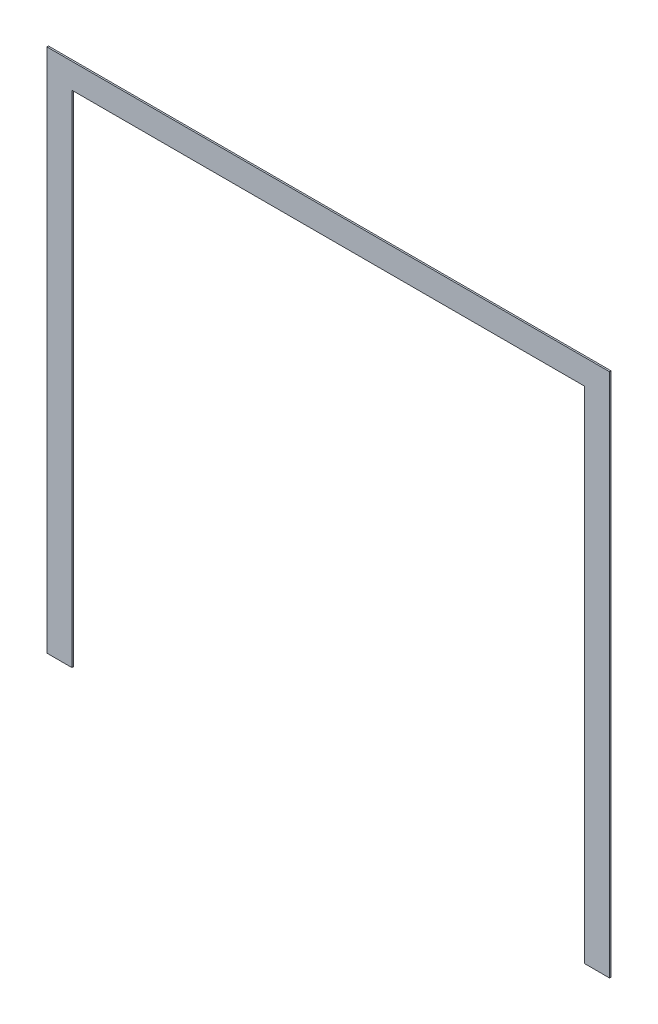
ISO-10303-21;
HEADER;
FILE_DESCRIPTION(('STEP AP214'),'2;1');
FILE_NAME('part.step','',(''),(''),'','','');
FILE_SCHEMA(('AUTOMOTIVE_DESIGN { 1 0 10303 214 1 1 1 1 }'));
ENDSEC;
DATA;
#1=APPLICATION_CONTEXT('core data for automotive mechanical design processes');
#2=APPLICATION_PROTOCOL_DEFINITION('international standard','automotive_design',2000,#1);
#3=PRODUCT_CONTEXT('',#1,'mechanical');
#4=PRODUCT('Part','Part','',(#3));
#5=PRODUCT_RELATED_PRODUCT_CATEGORY('part','',(#4));
#6=PRODUCT_DEFINITION_FORMATION('','',#4);
#7=PRODUCT_DEFINITION_CONTEXT('part definition',#1,'design');
#8=PRODUCT_DEFINITION('design','',#6,#7);
#9=PRODUCT_DEFINITION_SHAPE('','',#8);
#10=(LENGTH_UNIT() NAMED_UNIT(*) SI_UNIT(.MILLI.,.METRE.));
#11=(NAMED_UNIT(*) PLANE_ANGLE_UNIT() SI_UNIT($,.RADIAN.));
#12=(NAMED_UNIT(*) SI_UNIT($,.STERADIAN.) SOLID_ANGLE_UNIT());
#13=UNCERTAINTY_MEASURE_WITH_UNIT(LENGTH_MEASURE(1.E-05),#10,'distance_accuracy_value','');
#14=(GEOMETRIC_REPRESENTATION_CONTEXT(3) GLOBAL_UNCERTAINTY_ASSIGNED_CONTEXT((#13)) GLOBAL_UNIT_ASSIGNED_CONTEXT((#10,
#11,#12)) REPRESENTATION_CONTEXT('',''));
#15=CARTESIAN_POINT('',(0.,0.,0.));
#16=DIRECTION('',(0.,0.,1.));
#17=DIRECTION('',(1.,0.,0.));
#18=AXIS2_PLACEMENT_3D('',#15,#16,#17);
#19=CARTESIAN_POINT('',(386.733357334137,-2891.73158988953,0.));
#20=DIRECTION('',(0.,0.,1.));
#21=DIRECTION('',(1.,0.,0.));
#22=AXIS2_PLACEMENT_3D('',#19,#20,#21);
#23=PLANE('',#22);
#24=DIRECTION('',(1.,0.,0.));
#25=VECTOR('',#24,1.);
#26=CARTESIAN_POINT('',(386.733357334137,-2358.33158988953,0.));
#27=LINE('',#26,#25);
#28=CARTESIAN_POINT('',(958.233357334138,-2358.33158988953,0.));
#29=VERTEX_POINT('',#28);
#30=CARTESIAN_POINT('',(-184.766642665863,-2358.33158988953,0.));
#31=VERTEX_POINT('',#30);
#32=EDGE_CURVE('E124',#29,#31,#27,.F.);
#33=ORIENTED_EDGE('',*,*,#32,.F.);
#34=DIRECTION('',(0.,1.,0.));
#35=VECTOR('',#34,1.);
#36=CARTESIAN_POINT('',(958.233357334138,-2891.73158988953,0.));
#37=LINE('',#36,#35);
#38=CARTESIAN_POINT('',(958.233357334138,-3425.13158988953,0.));
#39=VERTEX_POINT('',#38);
#40=EDGE_CURVE('E119',#39,#29,#37,.T.);
#41=ORIENTED_EDGE('',*,*,#40,.F.);
#42=DIRECTION('',(1.,0.,0.));
#43=VECTOR('',#42,1.);
#44=CARTESIAN_POINT('',(932.833357334138,-3425.13158988953,0.));
#45=LINE('',#44,#43);
#46=CARTESIAN_POINT('',(907.433357334138,-3425.13158988953,0.));
#47=VERTEX_POINT('',#46);
#48=EDGE_CURVE('E113',#47,#39,#45,.T.);
#49=ORIENTED_EDGE('',*,*,#48,.F.);
#50=DIRECTION('',(0.,-1.,0.));
#51=VECTOR('',#50,1.);
#52=CARTESIAN_POINT('',(907.433357334138,-2917.13158988953,0.));
#53=LINE('',#52,#51);
#54=CARTESIAN_POINT('',(907.433357334138,-2409.13158988953,0.));
#55=VERTEX_POINT('',#54);
#56=EDGE_CURVE('E107',#55,#47,#53,.T.);
#57=ORIENTED_EDGE('',*,*,#56,.F.);
#58=DIRECTION('',(1.,0.,0.));
#59=VECTOR('',#58,1.);
#60=CARTESIAN_POINT('',(386.733357334137,-2409.13158988953,0.));
#61=LINE('',#60,#59);
#62=CARTESIAN_POINT('',(-133.966642665863,-2409.13158988953,0.));
#63=VERTEX_POINT('',#62);
#64=EDGE_CURVE('E101',#63,#55,#61,.T.);
#65=ORIENTED_EDGE('',*,*,#64,.F.);
#66=DIRECTION('',(0.,1.,0.));
#67=VECTOR('',#66,1.);
#68=CARTESIAN_POINT('',(-133.966642665863,-2917.13158988953,0.));
#69=LINE('',#68,#67);
#70=CARTESIAN_POINT('',(-133.966642665863,-3425.13158988953,0.));
#71=VERTEX_POINT('',#70);
#72=EDGE_CURVE('E77',#71,#63,#69,.T.);
#73=ORIENTED_EDGE('',*,*,#72,.F.);
#74=DIRECTION('',(1.,0.,0.));
#75=VECTOR('',#74,1.);
#76=CARTESIAN_POINT('',(-159.366642665863,-3425.13158988953,0.));
#77=LINE('',#76,#75);
#78=CARTESIAN_POINT('',(-184.766642665863,-3425.13158988953,0.));
#79=VERTEX_POINT('',#78);
#80=EDGE_CURVE('E79',#79,#71,#77,.T.);
#81=ORIENTED_EDGE('',*,*,#80,.F.);
#82=DIRECTION('',(0.,1.,0.));
#83=VECTOR('',#82,1.);
#84=CARTESIAN_POINT('',(-184.766642665863,-2891.73158988953,0.));
#85=LINE('',#84,#83);
#86=EDGE_CURVE('E17',#31,#79,#85,.F.);
#87=ORIENTED_EDGE('',*,*,#86,.F.);
#88=EDGE_LOOP('',(#33,#41,#49,#57,#65,#73,#81,#87));
#89=FACE_BOUND('',#88,.T.);
#90=ADVANCED_FACE('F14',(#89),#23,.F.);
#91=CARTESIAN_POINT('',(-184.766642665863,-2891.73158988953,3.175));
#92=DIRECTION('',(-1.,0.,0.));
#93=DIRECTION('',(0.,0.,1.));
#94=AXIS2_PLACEMENT_3D('',#91,#92,#93);
#95=PLANE('',#94);
#96=DIRECTION('',(0.,1.,0.));
#97=VECTOR('',#96,1.);
#98=CARTESIAN_POINT('',(-184.766642665863,-2891.73158988953,3.175));
#99=LINE('',#98,#97);
#100=CARTESIAN_POINT('',(-184.766642665863,-2358.33158988953,3.175));
#101=VERTEX_POINT('',#100);
#102=CARTESIAN_POINT('',(-184.766642665863,-3425.13158988953,3.175));
#103=VERTEX_POINT('',#102);
#104=EDGE_CURVE('E128',#101,#103,#99,.F.);
#105=ORIENTED_EDGE('',*,*,#104,.F.);
#106=DIRECTION('',(0.,0.,1.));
#107=VECTOR('',#106,1.);
#108=CARTESIAN_POINT('',(-184.766642665863,-2358.33158988953,3.175));
#109=LINE('',#108,#107);
#110=EDGE_CURVE('E90',#31,#101,#109,.T.);
#111=ORIENTED_EDGE('',*,*,#110,.F.);
#112=ORIENTED_EDGE('',*,*,#86,.T.);
#113=DIRECTION('',(0.,0.,-1.));
#114=VECTOR('',#113,1.);
#115=CARTESIAN_POINT('',(-184.766642665863,-3425.13158988953,3.175));
#116=LINE('',#115,#114);
#117=EDGE_CURVE('E85',#103,#79,#116,.T.);
#118=ORIENTED_EDGE('',*,*,#117,.F.);
#119=EDGE_LOOP('',(#105,#111,#112,#118));
#120=FACE_BOUND('',#119,.T.);
#121=ADVANCED_FACE('F87',(#120),#95,.T.);
#122=CARTESIAN_POINT('',(-159.366642665863,-3425.13158988953,3.175));
#123=DIRECTION('',(0.,-1.,0.));
#124=DIRECTION('',(0.,0.,-1.));
#125=AXIS2_PLACEMENT_3D('',#122,#123,#124);
#126=PLANE('',#125);
#127=DIRECTION('',(1.,0.,0.));
#128=VECTOR('',#127,1.);
#129=CARTESIAN_POINT('',(386.733357334137,-3425.13158988953,3.175));
#130=LINE('',#129,#128);
#131=CARTESIAN_POINT('',(-133.966642665863,-3425.13158988953,3.175));
#132=VERTEX_POINT('',#131);
#133=EDGE_CURVE('E94',#103,#132,#130,.T.);
#134=ORIENTED_EDGE('',*,*,#133,.F.);
#135=ORIENTED_EDGE('',*,*,#117,.T.);
#136=ORIENTED_EDGE('',*,*,#80,.T.);
#137=DIRECTION('',(0.,0.,1.));
#138=VECTOR('',#137,1.);
#139=CARTESIAN_POINT('',(-133.966642665863,-3425.13158988953,3.175));
#140=LINE('',#139,#138);
#141=EDGE_CURVE('E97',#132,#71,#140,.F.);
#142=ORIENTED_EDGE('',*,*,#141,.F.);
#143=EDGE_LOOP('',(#134,#135,#136,#142));
#144=FACE_BOUND('',#143,.T.);
#145=ADVANCED_FACE('F92',(#144),#126,.T.);
#146=CARTESIAN_POINT('',(-133.966642665863,-2917.13158988953,3.175));
#147=DIRECTION('',(1.,0.,0.));
#148=DIRECTION('',(0.,1.,0.));
#149=AXIS2_PLACEMENT_3D('',#146,#147,#148);
#150=PLANE('',#149);
#151=DIRECTION('',(0.,1.,0.));
#152=VECTOR('',#151,1.);
#153=CARTESIAN_POINT('',(-133.966642665863,-2891.73158988953,3.175));
#154=LINE('',#153,#152);
#155=CARTESIAN_POINT('',(-133.966642665863,-2409.13158988953,3.175));
#156=VERTEX_POINT('',#155);
#157=EDGE_CURVE('E131',#132,#156,#154,.T.);
#158=ORIENTED_EDGE('',*,*,#157,.F.);
#159=ORIENTED_EDGE('',*,*,#141,.T.);
#160=ORIENTED_EDGE('',*,*,#72,.T.);
#161=DIRECTION('',(0.,0.,-1.));
#162=VECTOR('',#161,1.);
#163=CARTESIAN_POINT('',(-133.966642665863,-2409.13158988953,3.175));
#164=LINE('',#163,#162);
#165=EDGE_CURVE('E104',#156,#63,#164,.T.);
#166=ORIENTED_EDGE('',*,*,#165,.F.);
#167=EDGE_LOOP('',(#158,#159,#160,#166));
#168=FACE_BOUND('',#167,.T.);
#169=ADVANCED_FACE('F158',(#168),#150,.T.);
#170=CARTESIAN_POINT('',(386.733357334137,-2409.13158988953,3.175));
#171=DIRECTION('',(0.,-1.,0.));
#172=DIRECTION('',(0.,0.,-1.));
#173=AXIS2_PLACEMENT_3D('',#170,#171,#172);
#174=PLANE('',#173);
#175=DIRECTION('',(1.,0.,0.));
#176=VECTOR('',#175,1.);
#177=CARTESIAN_POINT('',(386.733357334137,-2409.13158988953,3.175));
#178=LINE('',#177,#176);
#179=CARTESIAN_POINT('',(907.433357334138,-2409.13158988953,3.175));
#180=VERTEX_POINT('',#179);
#181=EDGE_CURVE('E134',#156,#180,#178,.T.);
#182=ORIENTED_EDGE('',*,*,#181,.F.);
#183=ORIENTED_EDGE('',*,*,#165,.T.);
#184=ORIENTED_EDGE('',*,*,#64,.T.);
#185=DIRECTION('',(0.,0.,1.));
#186=VECTOR('',#185,1.);
#187=CARTESIAN_POINT('',(907.433357334138,-2409.13158988953,3.175));
#188=LINE('',#187,#186);
#189=EDGE_CURVE('E110',#180,#55,#188,.F.);
#190=ORIENTED_EDGE('',*,*,#189,.F.);
#191=EDGE_LOOP('',(#182,#183,#184,#190));
#192=FACE_BOUND('',#191,.T.);
#193=ADVANCED_FACE('F155',(#192),#174,.T.);
#194=CARTESIAN_POINT('',(907.433357334138,-2917.13158988953,3.175));
#195=DIRECTION('',(-1.,0.,0.));
#196=DIRECTION('',(0.,-1.,0.));
#197=AXIS2_PLACEMENT_3D('',#194,#195,#196);
#198=PLANE('',#197);
#199=DIRECTION('',(0.,1.,0.));
#200=VECTOR('',#199,1.);
#201=CARTESIAN_POINT('',(907.433357334138,-2891.73158988953,3.175));
#202=LINE('',#201,#200);
#203=CARTESIAN_POINT('',(907.433357334138,-3425.13158988953,3.175));
#204=VERTEX_POINT('',#203);
#205=EDGE_CURVE('E137',#180,#204,#202,.F.);
#206=ORIENTED_EDGE('',*,*,#205,.F.);
#207=ORIENTED_EDGE('',*,*,#189,.T.);
#208=ORIENTED_EDGE('',*,*,#56,.T.);
#209=DIRECTION('',(0.,0.,-1.));
#210=VECTOR('',#209,1.);
#211=CARTESIAN_POINT('',(907.433357334138,-3425.13158988953,3.175));
#212=LINE('',#211,#210);
#213=EDGE_CURVE('E116',#204,#47,#212,.T.);
#214=ORIENTED_EDGE('',*,*,#213,.F.);
#215=EDGE_LOOP('',(#206,#207,#208,#214));
#216=FACE_BOUND('',#215,.T.);
#217=ADVANCED_FACE('F152',(#216),#198,.T.);
#218=CARTESIAN_POINT('',(932.833357334138,-3425.13158988953,3.175));
#219=DIRECTION('',(0.,-1.,0.));
#220=DIRECTION('',(0.,0.,-1.));
#221=AXIS2_PLACEMENT_3D('',#218,#219,#220);
#222=PLANE('',#221);
#223=DIRECTION('',(1.,0.,0.));
#224=VECTOR('',#223,1.);
#225=CARTESIAN_POINT('',(386.733357334137,-3425.13158988953,3.175));
#226=LINE('',#225,#224);
#227=CARTESIAN_POINT('',(958.233357334138,-3425.13158988953,3.175));
#228=VERTEX_POINT('',#227);
#229=EDGE_CURVE('E140',#204,#228,#226,.T.);
#230=ORIENTED_EDGE('',*,*,#229,.F.);
#231=ORIENTED_EDGE('',*,*,#213,.T.);
#232=ORIENTED_EDGE('',*,*,#48,.T.);
#233=DIRECTION('',(0.,0.,1.));
#234=VECTOR('',#233,1.);
#235=CARTESIAN_POINT('',(958.233357334138,-3425.13158988953,3.175));
#236=LINE('',#235,#234);
#237=EDGE_CURVE('E121',#228,#39,#236,.F.);
#238=ORIENTED_EDGE('',*,*,#237,.F.);
#239=EDGE_LOOP('',(#230,#231,#232,#238));
#240=FACE_BOUND('',#239,.T.);
#241=ADVANCED_FACE('F149',(#240),#222,.T.);
#242=CARTESIAN_POINT('',(958.233357334138,-2891.73158988953,3.175));
#243=DIRECTION('',(1.,0.,0.));
#244=DIRECTION('',(0.,1.,0.));
#245=AXIS2_PLACEMENT_3D('',#242,#243,#244);
#246=PLANE('',#245);
#247=DIRECTION('',(0.,1.,0.));
#248=VECTOR('',#247,1.);
#249=CARTESIAN_POINT('',(958.233357334138,-2891.73158988953,3.175));
#250=LINE('',#249,#248);
#251=CARTESIAN_POINT('',(958.233357334138,-2358.33158988953,3.175));
#252=VERTEX_POINT('',#251);
#253=EDGE_CURVE('E23',#228,#252,#250,.T.);
#254=ORIENTED_EDGE('',*,*,#253,.F.);
#255=ORIENTED_EDGE('',*,*,#237,.T.);
#256=ORIENTED_EDGE('',*,*,#40,.T.);
#257=DIRECTION('',(0.,0.,1.));
#258=VECTOR('',#257,1.);
#259=CARTESIAN_POINT('',(958.233357334138,-2358.33158988953,3.175));
#260=LINE('',#259,#258);
#261=EDGE_CURVE('E32',#252,#29,#260,.F.);
#262=ORIENTED_EDGE('',*,*,#261,.F.);
#263=EDGE_LOOP('',(#254,#255,#256,#262));
#264=FACE_BOUND('',#263,.T.);
#265=ADVANCED_FACE('F147',(#264),#246,.T.);
#266=CARTESIAN_POINT('',(386.733357334137,-2358.33158988953,3.175));
#267=DIRECTION('',(0.,1.,0.));
#268=DIRECTION('',(0.,0.,1.));
#269=AXIS2_PLACEMENT_3D('',#266,#267,#268);
#270=PLANE('',#269);
#271=DIRECTION('',(1.,0.,0.));
#272=VECTOR('',#271,1.);
#273=CARTESIAN_POINT('',(386.733357334137,-2358.33158988953,3.175));
#274=LINE('',#273,#272);
#275=EDGE_CURVE('E9',#252,#101,#274,.F.);
#276=ORIENTED_EDGE('',*,*,#275,.F.);
#277=ORIENTED_EDGE('',*,*,#261,.T.);
#278=ORIENTED_EDGE('',*,*,#32,.T.);
#279=ORIENTED_EDGE('',*,*,#110,.T.);
#280=EDGE_LOOP('',(#276,#277,#278,#279));
#281=FACE_BOUND('',#280,.T.);
#282=ADVANCED_FACE('F160',(#281),#270,.T.);
#283=CARTESIAN_POINT('',(386.733357334137,-2891.73158988953,3.175));
#284=DIRECTION('',(0.,0.,1.));
#285=DIRECTION('',(1.,0.,0.));
#286=AXIS2_PLACEMENT_3D('',#283,#284,#285);
#287=PLANE('',#286);
#288=ORIENTED_EDGE('',*,*,#253,.T.);
#289=ORIENTED_EDGE('',*,*,#275,.T.);
#290=ORIENTED_EDGE('',*,*,#104,.T.);
#291=ORIENTED_EDGE('',*,*,#133,.T.);
#292=ORIENTED_EDGE('',*,*,#157,.T.);
#293=ORIENTED_EDGE('',*,*,#181,.T.);
#294=ORIENTED_EDGE('',*,*,#205,.T.);
#295=ORIENTED_EDGE('',*,*,#229,.T.);
#296=EDGE_LOOP('',(#288,#289,#290,#291,#292,#293,#294,#295));
#297=FACE_BOUND('',#296,.T.);
#298=ADVANCED_FACE('F145',(#297),#287,.T.);
#299=CLOSED_SHELL('',(#90,#121,#145,#169,#193,#217,#241,#265,#282,#298));
#300=MANIFOLD_SOLID_BREP('B1',#299);
#301=ADVANCED_BREP_SHAPE_REPRESENTATION('',(#18,#300),#14);
#302=SHAPE_DEFINITION_REPRESENTATION(#9,#301);
ENDSEC;
END-ISO-10303-21;
